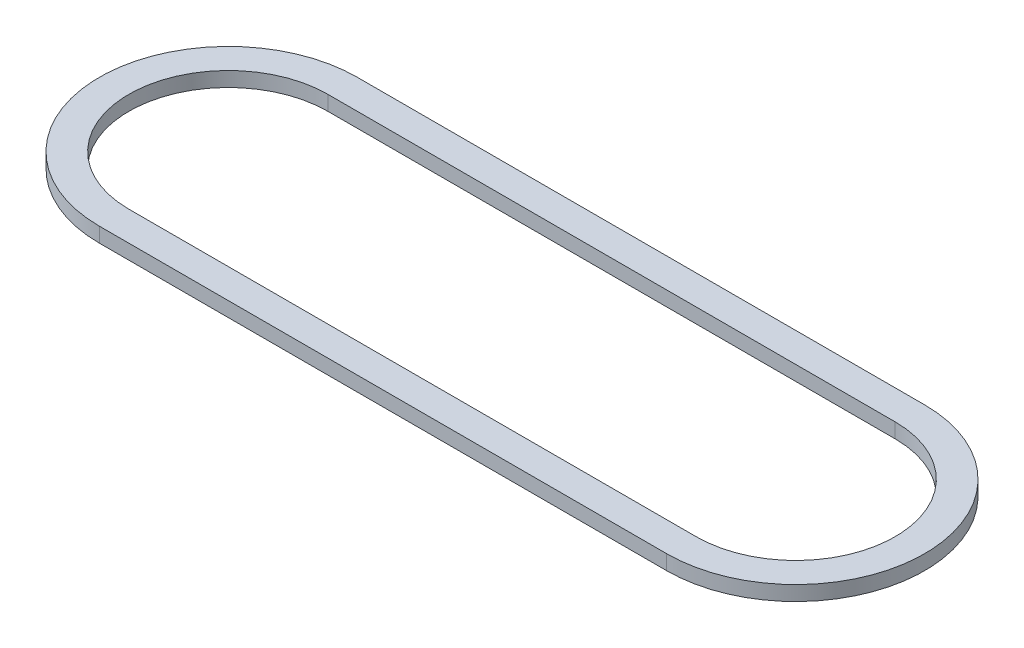
ISO-10303-21;
HEADER;
FILE_DESCRIPTION(('STEP AP214'),'2;1');
FILE_NAME('part.step','',(''),(''),'','','');
FILE_SCHEMA(('AUTOMOTIVE_DESIGN { 1 0 10303 214 1 1 1 1 }'));
ENDSEC;
DATA;
#1=APPLICATION_CONTEXT('core data for automotive mechanical design processes');
#2=APPLICATION_PROTOCOL_DEFINITION('international standard','automotive_design',2000,#1);
#3=PRODUCT_CONTEXT('',#1,'mechanical');
#4=PRODUCT('Part','Part','',(#3));
#5=PRODUCT_RELATED_PRODUCT_CATEGORY('part','',(#4));
#6=PRODUCT_DEFINITION_FORMATION('','',#4);
#7=PRODUCT_DEFINITION_CONTEXT('part definition',#1,'design');
#8=PRODUCT_DEFINITION('design','',#6,#7);
#9=PRODUCT_DEFINITION_SHAPE('','',#8);
#10=(LENGTH_UNIT() NAMED_UNIT(*) SI_UNIT(.MILLI.,.METRE.));
#11=(NAMED_UNIT(*) PLANE_ANGLE_UNIT() SI_UNIT($,.RADIAN.));
#12=(NAMED_UNIT(*) SI_UNIT($,.STERADIAN.) SOLID_ANGLE_UNIT());
#13=UNCERTAINTY_MEASURE_WITH_UNIT(LENGTH_MEASURE(1.E-05),#10,'distance_accuracy_value','');
#14=(GEOMETRIC_REPRESENTATION_CONTEXT(3) GLOBAL_UNCERTAINTY_ASSIGNED_CONTEXT((#13)) GLOBAL_UNIT_ASSIGNED_CONTEXT((#10,
#11,#12)) REPRESENTATION_CONTEXT('',''));
#15=CARTESIAN_POINT('',(0.,0.,0.));
#16=DIRECTION('',(0.,0.,1.));
#17=DIRECTION('',(1.,0.,0.));
#18=AXIS2_PLACEMENT_3D('',#15,#16,#17);
#19=CARTESIAN_POINT('',(-9.779,0.508,0.));
#20=DIRECTION('',(0.,1.,0.));
#21=DIRECTION('',(0.,0.,1.));
#22=AXIS2_PLACEMENT_3D('',#19,#20,#21);
#23=PLANE('',#22);
#24=CARTESIAN_POINT('',(-9.779,0.508,0.));
#25=DIRECTION('',(0.,1.,0.));
#26=DIRECTION('',(0.,0.,1.));
#27=AXIS2_PLACEMENT_3D('',#24,#25,#26);
#28=CIRCLE('',#27,4.445);
#29=CARTESIAN_POINT('',(-9.779,0.508,-4.445));
#30=VERTEX_POINT('',#29);
#31=CARTESIAN_POINT('',(-9.779,0.508,4.445));
#32=VERTEX_POINT('',#31);
#33=EDGE_CURVE('E133',#30,#32,#28,.T.);
#34=ORIENTED_EDGE('',*,*,#33,.T.);
#35=DIRECTION('',(1.,0.,0.));
#36=VECTOR('',#35,1.);
#37=CARTESIAN_POINT('',(-9.779,0.508,4.445));
#38=LINE('',#37,#36);
#39=CARTESIAN_POINT('',(9.779,0.508,4.445));
#40=VERTEX_POINT('',#39);
#41=EDGE_CURVE('E136',#32,#40,#38,.T.);
#42=ORIENTED_EDGE('',*,*,#41,.T.);
#43=CARTESIAN_POINT('',(9.779,0.508,0.));
#44=DIRECTION('',(0.,1.,0.));
#45=DIRECTION('',(0.,0.,1.));
#46=AXIS2_PLACEMENT_3D('',#43,#44,#45);
#47=CIRCLE('',#46,4.445);
#48=CARTESIAN_POINT('',(9.779,0.508,-4.44500000000001));
#49=VERTEX_POINT('',#48);
#50=EDGE_CURVE('E139',#40,#49,#47,.T.);
#51=ORIENTED_EDGE('',*,*,#50,.T.);
#52=DIRECTION('',(-1.,0.,0.));
#53=VECTOR('',#52,1.);
#54=CARTESIAN_POINT('',(-9.779,0.508,-4.445));
#55=LINE('',#54,#53);
#56=EDGE_CURVE('E141',#49,#30,#55,.T.);
#57=ORIENTED_EDGE('',*,*,#56,.T.);
#58=EDGE_LOOP('',(#34,#42,#51,#57));
#59=FACE_BOUND('',#58,.T.);
#60=DIRECTION('',(1.,0.,0.));
#61=VECTOR('',#60,1.);
#62=CARTESIAN_POINT('',(-9.779,0.508,3.429));
#63=LINE('',#62,#61);
#64=CARTESIAN_POINT('',(-9.779,0.508,3.429));
#65=VERTEX_POINT('',#64);
#66=CARTESIAN_POINT('',(9.779,0.508,3.429));
#67=VERTEX_POINT('',#66);
#68=EDGE_CURVE('E105',#65,#67,#63,.T.);
#69=ORIENTED_EDGE('',*,*,#68,.F.);
#70=CARTESIAN_POINT('',(-9.779,0.508,0.));
#71=DIRECTION('',(0.,1.,0.));
#72=DIRECTION('',(0.,0.,1.));
#73=AXIS2_PLACEMENT_3D('',#70,#71,#72);
#74=CIRCLE('',#73,3.429);
#75=CARTESIAN_POINT('',(-9.779,0.508,-3.429));
#76=VERTEX_POINT('',#75);
#77=EDGE_CURVE('E97',#76,#65,#74,.T.);
#78=ORIENTED_EDGE('',*,*,#77,.F.);
#79=DIRECTION('',(-1.,0.,0.));
#80=VECTOR('',#79,1.);
#81=CARTESIAN_POINT('',(-9.779,0.508,-3.429));
#82=LINE('',#81,#80);
#83=CARTESIAN_POINT('',(9.779,0.508,-3.42900000000001));
#84=VERTEX_POINT('',#83);
#85=EDGE_CURVE('E119',#84,#76,#82,.T.);
#86=ORIENTED_EDGE('',*,*,#85,.F.);
#87=CARTESIAN_POINT('',(9.779,0.508,0.));
#88=DIRECTION('',(0.,1.,0.));
#89=DIRECTION('',(0.,0.,1.));
#90=AXIS2_PLACEMENT_3D('',#87,#88,#89);
#91=CIRCLE('',#90,3.429);
#92=EDGE_CURVE('E117',#67,#84,#91,.T.);
#93=ORIENTED_EDGE('',*,*,#92,.F.);
#94=EDGE_LOOP('',(#69,#78,#86,#93));
#95=FACE_BOUND('',#94,.T.);
#96=ADVANCED_FACE('F32',(#59,#95),#23,.T.);
#97=CARTESIAN_POINT('',(-9.779,0.,0.));
#98=DIRECTION('',(0.,1.,0.));
#99=DIRECTION('',(0.,0.,1.));
#100=AXIS2_PLACEMENT_3D('',#97,#98,#99);
#101=PLANE('',#100);
#102=CARTESIAN_POINT('',(-9.779,0.,0.));
#103=DIRECTION('',(0.,1.,0.));
#104=DIRECTION('',(0.,0.,1.));
#105=AXIS2_PLACEMENT_3D('',#102,#103,#104);
#106=CIRCLE('',#105,4.445);
#107=CARTESIAN_POINT('',(-9.779,0.,-4.445));
#108=VERTEX_POINT('',#107);
#109=CARTESIAN_POINT('',(-9.779,0.,4.445));
#110=VERTEX_POINT('',#109);
#111=EDGE_CURVE('E113',#108,#110,#106,.T.);
#112=ORIENTED_EDGE('',*,*,#111,.F.);
#113=DIRECTION('',(-1.,0.,0.));
#114=VECTOR('',#113,1.);
#115=CARTESIAN_POINT('',(-9.779,0.,-4.445));
#116=LINE('',#115,#114);
#117=CARTESIAN_POINT('',(9.779,0.,-4.44500000000001));
#118=VERTEX_POINT('',#117);
#119=EDGE_CURVE('E137',#118,#108,#116,.T.);
#120=ORIENTED_EDGE('',*,*,#119,.F.);
#121=CARTESIAN_POINT('',(9.779,0.,0.));
#122=DIRECTION('',(0.,1.,0.));
#123=DIRECTION('',(0.,0.,1.));
#124=AXIS2_PLACEMENT_3D('',#121,#122,#123);
#125=CIRCLE('',#124,4.445);
#126=CARTESIAN_POINT('',(9.779,0.,4.445));
#127=VERTEX_POINT('',#126);
#128=EDGE_CURVE('E148',#127,#118,#125,.T.);
#129=ORIENTED_EDGE('',*,*,#128,.F.);
#130=DIRECTION('',(1.,0.,0.));
#131=VECTOR('',#130,1.);
#132=CARTESIAN_POINT('',(-9.779,0.,4.445));
#133=LINE('',#132,#131);
#134=EDGE_CURVE('E146',#110,#127,#133,.T.);
#135=ORIENTED_EDGE('',*,*,#134,.F.);
#136=EDGE_LOOP('',(#112,#120,#129,#135));
#137=FACE_BOUND('',#136,.T.);
#138=CARTESIAN_POINT('',(-9.779,0.,0.));
#139=DIRECTION('',(0.,1.,0.));
#140=DIRECTION('',(0.,0.,1.));
#141=AXIS2_PLACEMENT_3D('',#138,#139,#140);
#142=CIRCLE('',#141,3.429);
#143=CARTESIAN_POINT('',(-9.779,0.,-3.429));
#144=VERTEX_POINT('',#143);
#145=CARTESIAN_POINT('',(-9.779,0.,3.429));
#146=VERTEX_POINT('',#145);
#147=EDGE_CURVE('E55',#144,#146,#142,.T.);
#148=ORIENTED_EDGE('',*,*,#147,.T.);
#149=DIRECTION('',(1.,0.,0.));
#150=VECTOR('',#149,1.);
#151=CARTESIAN_POINT('',(-9.779,0.,3.429));
#152=LINE('',#151,#150);
#153=CARTESIAN_POINT('',(9.779,0.,3.429));
#154=VERTEX_POINT('',#153);
#155=EDGE_CURVE('E112',#146,#154,#152,.T.);
#156=ORIENTED_EDGE('',*,*,#155,.T.);
#157=CARTESIAN_POINT('',(9.779,0.,0.));
#158=DIRECTION('',(0.,1.,0.));
#159=DIRECTION('',(0.,0.,1.));
#160=AXIS2_PLACEMENT_3D('',#157,#158,#159);
#161=CIRCLE('',#160,3.429);
#162=CARTESIAN_POINT('',(9.779,0.,-3.42900000000001));
#163=VERTEX_POINT('',#162);
#164=EDGE_CURVE('E125',#154,#163,#161,.T.);
#165=ORIENTED_EDGE('',*,*,#164,.T.);
#166=DIRECTION('',(-1.,0.,0.));
#167=VECTOR('',#166,1.);
#168=CARTESIAN_POINT('',(-9.779,0.,-3.429));
#169=LINE('',#168,#167);
#170=EDGE_CURVE('E106',#163,#144,#169,.T.);
#171=ORIENTED_EDGE('',*,*,#170,.T.);
#172=EDGE_LOOP('',(#148,#156,#165,#171));
#173=FACE_BOUND('',#172,.T.);
#174=ADVANCED_FACE('F166',(#137,#173),#101,.F.);
#175=CARTESIAN_POINT('',(-9.779,0.508,0.));
#176=DIRECTION('',(0.,-1.,0.));
#177=DIRECTION('',(0.,0.,-1.));
#178=AXIS2_PLACEMENT_3D('',#175,#176,#177);
#179=CYLINDRICAL_SURFACE('',#178,4.445);
#180=ORIENTED_EDGE('',*,*,#111,.T.);
#181=DIRECTION('',(0.,-1.,0.));
#182=VECTOR('',#181,1.);
#183=CARTESIAN_POINT('',(-9.779,0.508,4.445));
#184=LINE('',#183,#182);
#185=EDGE_CURVE('E11',#32,#110,#184,.T.);
#186=ORIENTED_EDGE('',*,*,#185,.F.);
#187=ORIENTED_EDGE('',*,*,#33,.F.);
#188=DIRECTION('',(0.,-1.,0.));
#189=VECTOR('',#188,1.);
#190=CARTESIAN_POINT('',(-9.779,0.508,-4.445));
#191=LINE('',#190,#189);
#192=EDGE_CURVE('E143',#30,#108,#191,.T.);
#193=ORIENTED_EDGE('',*,*,#192,.T.);
#194=EDGE_LOOP('',(#180,#186,#187,#193));
#195=FACE_BOUND('',#194,.T.);
#196=ADVANCED_FACE('F34',(#195),#179,.T.);
#197=CARTESIAN_POINT('',(-9.779,0.508,4.445));
#198=DIRECTION('',(0.,0.,-1.));
#199=DIRECTION('',(-1.,0.,0.));
#200=AXIS2_PLACEMENT_3D('',#197,#198,#199);
#201=PLANE('',#200);
#202=ORIENTED_EDGE('',*,*,#134,.T.);
#203=DIRECTION('',(0.,-1.,0.));
#204=VECTOR('',#203,1.);
#205=CARTESIAN_POINT('',(9.779,0.508,4.445));
#206=LINE('',#205,#204);
#207=EDGE_CURVE('E40',#40,#127,#206,.T.);
#208=ORIENTED_EDGE('',*,*,#207,.F.);
#209=ORIENTED_EDGE('',*,*,#41,.F.);
#210=ORIENTED_EDGE('',*,*,#185,.T.);
#211=EDGE_LOOP('',(#202,#208,#209,#210));
#212=FACE_BOUND('',#211,.T.);
#213=ADVANCED_FACE('F176',(#212),#201,.F.);
#214=CARTESIAN_POINT('',(9.779,0.508,0.));
#215=DIRECTION('',(0.,-1.,0.));
#216=DIRECTION('',(0.,0.,-1.));
#217=AXIS2_PLACEMENT_3D('',#214,#215,#216);
#218=CYLINDRICAL_SURFACE('',#217,4.445);
#219=ORIENTED_EDGE('',*,*,#128,.T.);
#220=DIRECTION('',(0.,-1.,0.));
#221=VECTOR('',#220,1.);
#222=CARTESIAN_POINT('',(9.779,0.508,-4.44500000000001));
#223=LINE('',#222,#221);
#224=EDGE_CURVE('E153',#49,#118,#223,.T.);
#225=ORIENTED_EDGE('',*,*,#224,.F.);
#226=ORIENTED_EDGE('',*,*,#50,.F.);
#227=ORIENTED_EDGE('',*,*,#207,.T.);
#228=EDGE_LOOP('',(#219,#225,#226,#227));
#229=FACE_BOUND('',#228,.T.);
#230=ADVANCED_FACE('F160',(#229),#218,.T.);
#231=CARTESIAN_POINT('',(-9.779,0.508,-4.445));
#232=DIRECTION('',(0.,0.,1.));
#233=DIRECTION('',(1.,0.,0.));
#234=AXIS2_PLACEMENT_3D('',#231,#232,#233);
#235=PLANE('',#234);
#236=ORIENTED_EDGE('',*,*,#119,.T.);
#237=ORIENTED_EDGE('',*,*,#192,.F.);
#238=ORIENTED_EDGE('',*,*,#56,.F.);
#239=ORIENTED_EDGE('',*,*,#224,.T.);
#240=EDGE_LOOP('',(#236,#237,#238,#239));
#241=FACE_BOUND('',#240,.T.);
#242=ADVANCED_FACE('F170',(#241),#235,.F.);
#243=CARTESIAN_POINT('',(-9.779,0.508,0.));
#244=DIRECTION('',(0.,-1.,0.));
#245=DIRECTION('',(0.,0.,-1.));
#246=AXIS2_PLACEMENT_3D('',#243,#244,#245);
#247=CYLINDRICAL_SURFACE('',#246,3.429);
#248=ORIENTED_EDGE('',*,*,#147,.F.);
#249=DIRECTION('',(0.,-1.,0.));
#250=VECTOR('',#249,1.);
#251=CARTESIAN_POINT('',(-9.779,0.508,-3.429));
#252=LINE('',#251,#250);
#253=EDGE_CURVE('E101',#76,#144,#252,.T.);
#254=ORIENTED_EDGE('',*,*,#253,.F.);
#255=ORIENTED_EDGE('',*,*,#77,.T.);
#256=DIRECTION('',(0.,-1.,0.));
#257=VECTOR('',#256,1.);
#258=CARTESIAN_POINT('',(-9.779,0.508,3.429));
#259=LINE('',#258,#257);
#260=EDGE_CURVE('E100',#65,#146,#259,.T.);
#261=ORIENTED_EDGE('',*,*,#260,.T.);
#262=EDGE_LOOP('',(#248,#254,#255,#261));
#263=FACE_BOUND('',#262,.T.);
#264=ADVANCED_FACE('F99',(#263),#247,.F.);
#265=CARTESIAN_POINT('',(-9.779,0.508,3.429));
#266=DIRECTION('',(0.,0.,-1.));
#267=DIRECTION('',(-1.,0.,0.));
#268=AXIS2_PLACEMENT_3D('',#265,#266,#267);
#269=PLANE('',#268);
#270=ORIENTED_EDGE('',*,*,#155,.F.);
#271=ORIENTED_EDGE('',*,*,#260,.F.);
#272=ORIENTED_EDGE('',*,*,#68,.T.);
#273=DIRECTION('',(0.,-1.,0.));
#274=VECTOR('',#273,1.);
#275=CARTESIAN_POINT('',(9.779,0.508,3.429));
#276=LINE('',#275,#274);
#277=EDGE_CURVE('E114',#67,#154,#276,.T.);
#278=ORIENTED_EDGE('',*,*,#277,.T.);
#279=EDGE_LOOP('',(#270,#271,#272,#278));
#280=FACE_BOUND('',#279,.T.);
#281=ADVANCED_FACE('F109',(#280),#269,.T.);
#282=CARTESIAN_POINT('',(9.779,0.508,0.));
#283=DIRECTION('',(0.,-1.,0.));
#284=DIRECTION('',(0.,0.,-1.));
#285=AXIS2_PLACEMENT_3D('',#282,#283,#284);
#286=CYLINDRICAL_SURFACE('',#285,3.429);
#287=ORIENTED_EDGE('',*,*,#164,.F.);
#288=ORIENTED_EDGE('',*,*,#277,.F.);
#289=ORIENTED_EDGE('',*,*,#92,.T.);
#290=DIRECTION('',(0.,-1.,0.));
#291=VECTOR('',#290,1.);
#292=CARTESIAN_POINT('',(9.779,0.508,-3.42900000000001));
#293=LINE('',#292,#291);
#294=EDGE_CURVE('E47',#84,#163,#293,.T.);
#295=ORIENTED_EDGE('',*,*,#294,.T.);
#296=EDGE_LOOP('',(#287,#288,#289,#295));
#297=FACE_BOUND('',#296,.T.);
#298=ADVANCED_FACE('F199',(#297),#286,.F.);
#299=CARTESIAN_POINT('',(-9.779,0.508,-3.429));
#300=DIRECTION('',(0.,0.,1.));
#301=DIRECTION('',(1.,0.,0.));
#302=AXIS2_PLACEMENT_3D('',#299,#300,#301);
#303=PLANE('',#302);
#304=ORIENTED_EDGE('',*,*,#170,.F.);
#305=ORIENTED_EDGE('',*,*,#294,.F.);
#306=ORIENTED_EDGE('',*,*,#85,.T.);
#307=ORIENTED_EDGE('',*,*,#253,.T.);
#308=EDGE_LOOP('',(#304,#305,#306,#307));
#309=FACE_BOUND('',#308,.T.);
#310=ADVANCED_FACE('F203',(#309),#303,.T.);
#311=CLOSED_SHELL('',(#96,#174,#196,#213,#230,#242,#264,#281,#298,#310));
#312=MANIFOLD_SOLID_BREP('B2',#311);
#313=ADVANCED_BREP_SHAPE_REPRESENTATION('',(#18,#312),#14);
#314=SHAPE_DEFINITION_REPRESENTATION(#9,#313);
ENDSEC;
END-ISO-10303-21;
